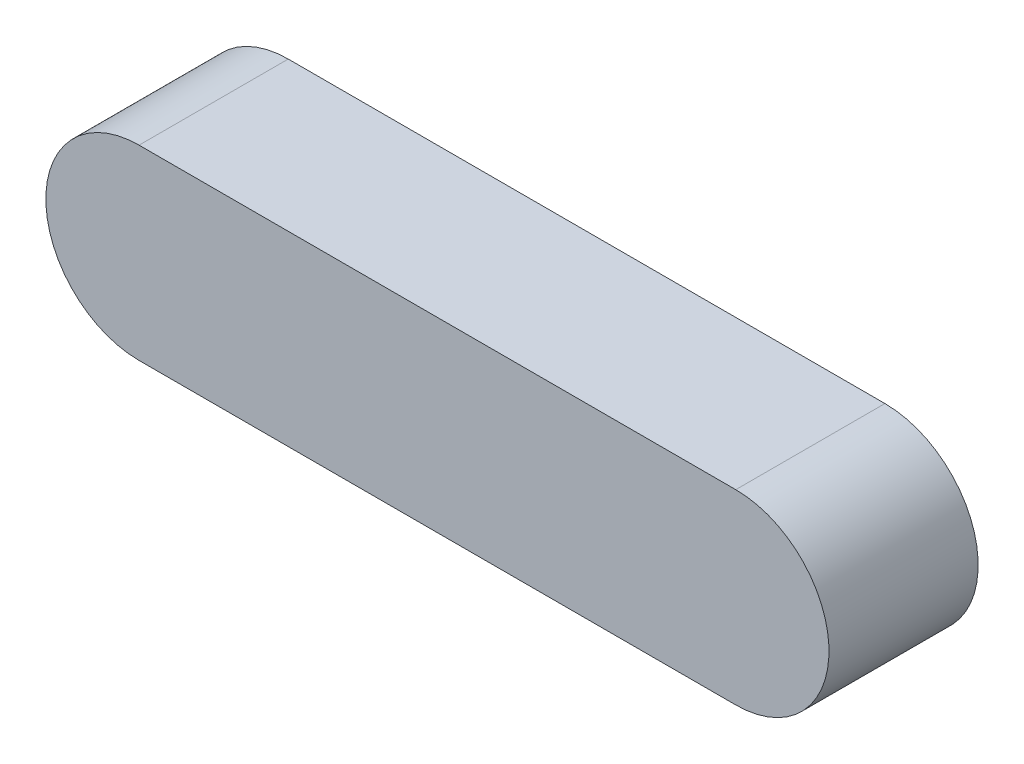
ISO-10303-21;
HEADER;
FILE_DESCRIPTION(('STEP AP214'),'2;1');
FILE_NAME('part.step','',(''),(''),'','','');
FILE_SCHEMA(('AUTOMOTIVE_DESIGN { 1 0 10303 214 1 1 1 1 }'));
ENDSEC;
DATA;
#1=APPLICATION_CONTEXT('core data for automotive mechanical design processes');
#2=APPLICATION_PROTOCOL_DEFINITION('international standard','automotive_design',2000,#1);
#3=PRODUCT_CONTEXT('',#1,'mechanical');
#4=PRODUCT('Part','Part','',(#3));
#5=PRODUCT_RELATED_PRODUCT_CATEGORY('part','',(#4));
#6=PRODUCT_DEFINITION_FORMATION('','',#4);
#7=PRODUCT_DEFINITION_CONTEXT('part definition',#1,'design');
#8=PRODUCT_DEFINITION('design','',#6,#7);
#9=PRODUCT_DEFINITION_SHAPE('','',#8);
#10=(LENGTH_UNIT() NAMED_UNIT(*) SI_UNIT(.MILLI.,.METRE.));
#11=(NAMED_UNIT(*) PLANE_ANGLE_UNIT() SI_UNIT($,.RADIAN.));
#12=(NAMED_UNIT(*) SI_UNIT($,.STERADIAN.) SOLID_ANGLE_UNIT());
#13=UNCERTAINTY_MEASURE_WITH_UNIT(LENGTH_MEASURE(1.E-05),#10,'distance_accuracy_value','');
#14=(GEOMETRIC_REPRESENTATION_CONTEXT(3) GLOBAL_UNCERTAINTY_ASSIGNED_CONTEXT((#13)) GLOBAL_UNIT_ASSIGNED_CONTEXT((#10,
#11,#12)) REPRESENTATION_CONTEXT('',''));
#15=CARTESIAN_POINT('',(0.,0.,0.));
#16=DIRECTION('',(0.,0.,1.));
#17=DIRECTION('',(1.,0.,0.));
#18=AXIS2_PLACEMENT_3D('',#15,#16,#17);
#19=CARTESIAN_POINT('',(-11.4953271028037,0.,8.));
#20=DIRECTION('',(0.,0.,-1.));
#21=DIRECTION('',(-1.,0.,0.));
#22=AXIS2_PLACEMENT_3D('',#19,#20,#21);
#23=CYLINDRICAL_SURFACE('',#22,5.);
#24=CARTESIAN_POINT('',(-11.4953271028037,0.,0.));
#25=DIRECTION('',(0.,0.,1.));
#26=DIRECTION('',(1.,0.,0.));
#27=AXIS2_PLACEMENT_3D('',#24,#25,#26);
#28=CIRCLE('',#27,5.);
#29=CARTESIAN_POINT('',(-11.4953271028037,5.,0.));
#30=VERTEX_POINT('',#29);
#31=CARTESIAN_POINT('',(-11.4953271028037,-5.,0.));
#32=VERTEX_POINT('',#31);
#33=EDGE_CURVE('E107',#30,#32,#28,.T.);
#34=ORIENTED_EDGE('',*,*,#33,.T.);
#35=DIRECTION('',(0.,0.,-1.));
#36=VECTOR('',#35,1.);
#37=CARTESIAN_POINT('',(-11.4953271028037,-5.,8.));
#38=LINE('',#37,#36);
#39=CARTESIAN_POINT('',(-11.4953271028037,-5.,8.));
#40=VERTEX_POINT('',#39);
#41=EDGE_CURVE('E11',#40,#32,#38,.T.);
#42=ORIENTED_EDGE('',*,*,#41,.F.);
#43=CARTESIAN_POINT('',(-11.4953271028037,0.,8.));
#44=DIRECTION('',(0.,0.,1.));
#45=DIRECTION('',(1.,0.,0.));
#46=AXIS2_PLACEMENT_3D('',#43,#44,#45);
#47=CIRCLE('',#46,5.);
#48=CARTESIAN_POINT('',(-11.4953271028037,5.,8.));
#49=VERTEX_POINT('',#48);
#50=EDGE_CURVE('E91',#49,#40,#47,.T.);
#51=ORIENTED_EDGE('',*,*,#50,.F.);
#52=DIRECTION('',(0.,0.,-1.));
#53=VECTOR('',#52,1.);
#54=CARTESIAN_POINT('',(-11.4953271028037,5.,8.));
#55=LINE('',#54,#53);
#56=EDGE_CURVE('E103',#49,#30,#55,.T.);
#57=ORIENTED_EDGE('',*,*,#56,.T.);
#58=EDGE_LOOP('',(#34,#42,#51,#57));
#59=FACE_BOUND('',#58,.T.);
#60=ADVANCED_FACE('F39',(#59),#23,.T.);
#61=CARTESIAN_POINT('',(-11.4953271028037,-5.,8.));
#62=DIRECTION('',(0.,1.,0.));
#63=DIRECTION('',(0.,0.,1.));
#64=AXIS2_PLACEMENT_3D('',#61,#62,#63);
#65=PLANE('',#64);
#66=DIRECTION('',(1.,0.,0.));
#67=VECTOR('',#66,1.);
#68=CARTESIAN_POINT('',(-11.4953271028037,-5.,0.));
#69=LINE('',#68,#67);
#70=CARTESIAN_POINT('',(20.5046728971963,-5.,0.));
#71=VERTEX_POINT('',#70);
#72=EDGE_CURVE('E96',#32,#71,#69,.T.);
#73=ORIENTED_EDGE('',*,*,#72,.T.);
#74=DIRECTION('',(0.,0.,-1.));
#75=VECTOR('',#74,1.);
#76=CARTESIAN_POINT('',(20.5046728971963,-5.,8.));
#77=LINE('',#76,#75);
#78=CARTESIAN_POINT('',(20.5046728971963,-5.,8.));
#79=VERTEX_POINT('',#78);
#80=EDGE_CURVE('E48',#79,#71,#77,.T.);
#81=ORIENTED_EDGE('',*,*,#80,.F.);
#82=DIRECTION('',(1.,0.,0.));
#83=VECTOR('',#82,1.);
#84=CARTESIAN_POINT('',(-11.4953271028037,-5.,8.));
#85=LINE('',#84,#83);
#86=EDGE_CURVE('E86',#40,#79,#85,.T.);
#87=ORIENTED_EDGE('',*,*,#86,.F.);
#88=ORIENTED_EDGE('',*,*,#41,.T.);
#89=EDGE_LOOP('',(#73,#81,#87,#88));
#90=FACE_BOUND('',#89,.T.);
#91=ADVANCED_FACE('F95',(#90),#65,.F.);
#92=CARTESIAN_POINT('',(20.5046728971963,0.,8.));
#93=DIRECTION('',(0.,0.,-1.));
#94=DIRECTION('',(-1.,0.,0.));
#95=AXIS2_PLACEMENT_3D('',#92,#93,#94);
#96=CYLINDRICAL_SURFACE('',#95,5.);
#97=CARTESIAN_POINT('',(20.5046728971963,0.,0.));
#98=DIRECTION('',(0.,0.,1.));
#99=DIRECTION('',(1.,0.,0.));
#100=AXIS2_PLACEMENT_3D('',#97,#98,#99);
#101=CIRCLE('',#100,5.);
#102=CARTESIAN_POINT('',(20.5046728971963,5.,0.));
#103=VERTEX_POINT('',#102);
#104=EDGE_CURVE('E73',#71,#103,#101,.T.);
#105=ORIENTED_EDGE('',*,*,#104,.T.);
#106=DIRECTION('',(0.,0.,-1.));
#107=VECTOR('',#106,1.);
#108=CARTESIAN_POINT('',(20.5046728971963,5.,8.));
#109=LINE('',#108,#107);
#110=CARTESIAN_POINT('',(20.5046728971963,5.,8.));
#111=VERTEX_POINT('',#110);
#112=EDGE_CURVE('E98',#111,#103,#109,.T.);
#113=ORIENTED_EDGE('',*,*,#112,.F.);
#114=CARTESIAN_POINT('',(20.5046728971963,0.,8.));
#115=DIRECTION('',(0.,0.,1.));
#116=DIRECTION('',(1.,0.,0.));
#117=AXIS2_PLACEMENT_3D('',#114,#115,#116);
#118=CIRCLE('',#117,5.);
#119=EDGE_CURVE('E89',#79,#111,#118,.T.);
#120=ORIENTED_EDGE('',*,*,#119,.F.);
#121=ORIENTED_EDGE('',*,*,#80,.T.);
#122=EDGE_LOOP('',(#105,#113,#120,#121));
#123=FACE_BOUND('',#122,.T.);
#124=ADVANCED_FACE('F99',(#123),#96,.T.);
#125=CARTESIAN_POINT('',(-11.4953271028037,5.,8.));
#126=DIRECTION('',(0.,-1.,0.));
#127=DIRECTION('',(0.,0.,-1.));
#128=AXIS2_PLACEMENT_3D('',#125,#126,#127);
#129=PLANE('',#128);
#130=DIRECTION('',(-1.,0.,0.));
#131=VECTOR('',#130,1.);
#132=CARTESIAN_POINT('',(-11.4953271028037,5.,0.));
#133=LINE('',#132,#131);
#134=EDGE_CURVE('E79',#103,#30,#133,.T.);
#135=ORIENTED_EDGE('',*,*,#134,.T.);
#136=ORIENTED_EDGE('',*,*,#56,.F.);
#137=DIRECTION('',(-1.,0.,0.));
#138=VECTOR('',#137,1.);
#139=CARTESIAN_POINT('',(-11.4953271028037,5.,8.));
#140=LINE('',#139,#138);
#141=EDGE_CURVE('E56',#111,#49,#140,.T.);
#142=ORIENTED_EDGE('',*,*,#141,.F.);
#143=ORIENTED_EDGE('',*,*,#112,.T.);
#144=EDGE_LOOP('',(#135,#136,#142,#143));
#145=FACE_BOUND('',#144,.T.);
#146=ADVANCED_FACE('F120',(#145),#129,.F.);
#147=CARTESIAN_POINT('',(-11.4953271028037,0.,8.));
#148=DIRECTION('',(0.,0.,1.));
#149=DIRECTION('',(1.,0.,0.));
#150=AXIS2_PLACEMENT_3D('',#147,#148,#149);
#151=PLANE('',#150);
#152=ORIENTED_EDGE('',*,*,#50,.T.);
#153=ORIENTED_EDGE('',*,*,#86,.T.);
#154=ORIENTED_EDGE('',*,*,#119,.T.);
#155=ORIENTED_EDGE('',*,*,#141,.T.);
#156=EDGE_LOOP('',(#152,#153,#154,#155));
#157=FACE_BOUND('',#156,.T.);
#158=ADVANCED_FACE('F87',(#157),#151,.T.);
#159=CARTESIAN_POINT('',(-11.4953271028037,0.,0.));
#160=DIRECTION('',(0.,0.,1.));
#161=DIRECTION('',(1.,0.,0.));
#162=AXIS2_PLACEMENT_3D('',#159,#160,#161);
#163=PLANE('',#162);
#164=ORIENTED_EDGE('',*,*,#33,.F.);
#165=ORIENTED_EDGE('',*,*,#134,.F.);
#166=ORIENTED_EDGE('',*,*,#104,.F.);
#167=ORIENTED_EDGE('',*,*,#72,.F.);
#168=EDGE_LOOP('',(#164,#165,#166,#167));
#169=FACE_BOUND('',#168,.T.);
#170=ADVANCED_FACE('F123',(#169),#163,.F.);
#171=CLOSED_SHELL('',(#60,#91,#124,#146,#158,#170));
#172=MANIFOLD_SOLID_BREP('B2',#171);
#173=ADVANCED_BREP_SHAPE_REPRESENTATION('',(#18,#172),#14);
#174=SHAPE_DEFINITION_REPRESENTATION(#9,#173);
ENDSEC;
END-ISO-10303-21;
